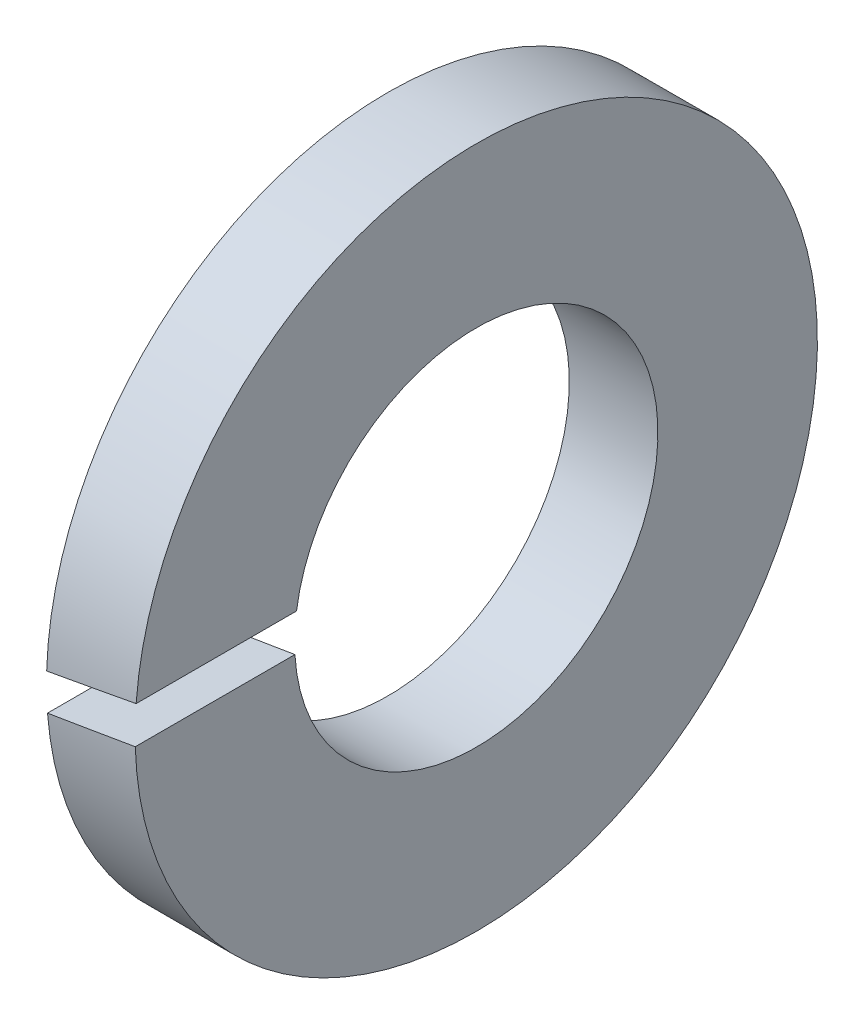
ISO-10303-21;
HEADER;
FILE_DESCRIPTION(('STEP AP214'),'2;1');
FILE_NAME('part.step','',(''),(''),'','','');
FILE_SCHEMA(('AUTOMOTIVE_DESIGN { 1 0 10303 214 1 1 1 1 }'));
ENDSEC;
DATA;
#1=APPLICATION_CONTEXT('core data for automotive mechanical design processes');
#2=APPLICATION_PROTOCOL_DEFINITION('international standard','automotive_design',2000,#1);
#3=PRODUCT_CONTEXT('',#1,'mechanical');
#4=PRODUCT('Part','Part','',(#3));
#5=PRODUCT_RELATED_PRODUCT_CATEGORY('part','',(#4));
#6=PRODUCT_DEFINITION_FORMATION('','',#4);
#7=PRODUCT_DEFINITION_CONTEXT('part definition',#1,'design');
#8=PRODUCT_DEFINITION('design','',#6,#7);
#9=PRODUCT_DEFINITION_SHAPE('','',#8);
#10=(LENGTH_UNIT() NAMED_UNIT(*) SI_UNIT(.MILLI.,.METRE.));
#11=(NAMED_UNIT(*) PLANE_ANGLE_UNIT() SI_UNIT($,.RADIAN.));
#12=(NAMED_UNIT(*) SI_UNIT($,.STERADIAN.) SOLID_ANGLE_UNIT());
#13=UNCERTAINTY_MEASURE_WITH_UNIT(LENGTH_MEASURE(1.E-05),#10,'distance_accuracy_value','');
#14=(GEOMETRIC_REPRESENTATION_CONTEXT(3) GLOBAL_UNCERTAINTY_ASSIGNED_CONTEXT((#13)) GLOBAL_UNIT_ASSIGNED_CONTEXT((#10,
#11,#12)) REPRESENTATION_CONTEXT('',''));
#15=CARTESIAN_POINT('',(0.,0.,0.));
#16=DIRECTION('',(0.,0.,1.));
#17=DIRECTION('',(1.,0.,0.));
#18=AXIS2_PLACEMENT_3D('',#15,#16,#17);
#19=CARTESIAN_POINT('',(-1.,5.9,0.));
#20=DIRECTION('',(-1.,0.,0.));
#21=DIRECTION('',(0.,0.,1.));
#22=AXIS2_PLACEMENT_3D('',#19,#20,#21);
#23=PLANE('',#22);
#24=DIRECTION('',(0.,0.,1.));
#25=VECTOR('',#24,1.);
#26=CARTESIAN_POINT('',(-1.,-0.59265189158162,0.));
#27=LINE('',#26,#25);
#28=CARTESIAN_POINT('',(-1.,-0.592651891581621,7.67715857172462));
#29=VERTEX_POINT('',#28);
#30=CARTESIAN_POINT('',(-1.,-0.59265189158162,4.05694019371801));
#31=VERTEX_POINT('',#30);
#32=EDGE_CURVE('E54',#29,#31,#27,.F.);
#33=ORIENTED_EDGE('',*,*,#32,.T.);
#34=CARTESIAN_POINT('',(-1.,0.,0.));
#35=DIRECTION('',(1.,0.,0.));
#36=DIRECTION('',(0.,0.,-1.));
#37=AXIS2_PLACEMENT_3D('',#34,#35,#36);
#38=CIRCLE('',#37,4.1);
#39=CARTESIAN_POINT('',(-1.,0.239997930164691,4.09296970346919));
#40=VERTEX_POINT('',#39);
#41=EDGE_CURVE('E21',#31,#40,#38,.T.);
#42=ORIENTED_EDGE('',*,*,#41,.T.);
#43=DIRECTION('',(0.,0.,1.));
#44=VECTOR('',#43,1.);
#45=CARTESIAN_POINT('',(-1.,0.239997930164691,0.));
#46=LINE('',#45,#44);
#47=CARTESIAN_POINT('',(-1.,0.239997930164691,7.69625889595176));
#48=VERTEX_POINT('',#47);
#49=EDGE_CURVE('E58',#40,#48,#46,.T.);
#50=ORIENTED_EDGE('',*,*,#49,.T.);
#51=CARTESIAN_POINT('',(-1.,0.,0.));
#52=DIRECTION('',(1.,0.,0.));
#53=DIRECTION('',(0.,0.,-1.));
#54=AXIS2_PLACEMENT_3D('',#51,#52,#53);
#55=CIRCLE('',#54,7.7);
#56=EDGE_CURVE('E81',#29,#48,#55,.T.);
#57=ORIENTED_EDGE('',*,*,#56,.F.);
#58=EDGE_LOOP('',(#33,#42,#50,#57));
#59=FACE_BOUND('',#58,.T.);
#60=ADVANCED_FACE('F18',(#59),#23,.T.);
#61=CARTESIAN_POINT('',(-2.04081125886786,0.056474823401145,0.));
#62=DIRECTION('',(-0.17364817766693,0.984807753012208,0.));
#63=DIRECTION('',(-0.984807753012208,-0.17364817766693,0.));
#64=AXIS2_PLACEMENT_3D('',#61,#62,#63);
#65=PLANE('',#64);
#66=CARTESIAN_POINT('',(-2.3610958980889,0.,0.));
#67=DIRECTION('',(-0.17364817766693,0.984807753012208,0.));
#68=DIRECTION('',(0.984807753012208,0.17364817766693,0.));
#69=AXIS2_PLACEMENT_3D('',#66,#67,#68);
#70=ELLIPSE('',#69,44.3425327202061,7.7);
#71=CARTESIAN_POINT('',(1.,0.59265189158162,7.67715857172461));
#72=VERTEX_POINT('',#71);
#73=EDGE_CURVE('E69',#48,#72,#70,.T.);
#74=ORIENTED_EDGE('',*,*,#73,.F.);
#75=ORIENTED_EDGE('',*,*,#49,.F.);
#76=CARTESIAN_POINT('',(-2.3610958980889,0.,0.));
#77=DIRECTION('',(-0.17364817766693,0.984807753012208,0.));
#78=DIRECTION('',(0.984807753012208,0.17364817766693,0.));
#79=AXIS2_PLACEMENT_3D('',#76,#77,#78);
#80=ELLIPSE('',#79,23.6109589808889,4.1);
#81=CARTESIAN_POINT('',(1.,0.59265189158162,4.05694019371801));
#82=VERTEX_POINT('',#81);
#83=EDGE_CURVE('E63',#40,#82,#80,.T.);
#84=ORIENTED_EDGE('',*,*,#83,.T.);
#85=DIRECTION('',(0.,0.,-1.));
#86=VECTOR('',#85,1.);
#87=CARTESIAN_POINT('',(1.,0.59265189158162,0.));
#88=LINE('',#87,#86);
#89=EDGE_CURVE('E84',#72,#82,#88,.T.);
#90=ORIENTED_EDGE('',*,*,#89,.F.);
#91=EDGE_LOOP('',(#74,#75,#84,#90));
#92=FACE_BOUND('',#91,.T.);
#93=ADVANCED_FACE('F65',(#92),#65,.F.);
#94=CARTESIAN_POINT('',(0.,0.,0.));
#95=DIRECTION('',(1.,0.,0.));
#96=DIRECTION('',(0.,0.,-1.));
#97=AXIS2_PLACEMENT_3D('',#94,#95,#96);
#98=CYLINDRICAL_SURFACE('',#97,4.1);
#99=ORIENTED_EDGE('',*,*,#83,.F.);
#100=ORIENTED_EDGE('',*,*,#41,.F.);
#101=CARTESIAN_POINT('',(2.3610958980889,0.,0.));
#102=DIRECTION('',(0.17364817766693,-0.984807753012208,0.));
#103=DIRECTION('',(0.984807753012208,0.17364817766693,0.));
#104=AXIS2_PLACEMENT_3D('',#101,#102,#103);
#105=ELLIPSE('',#104,23.6109589808889,4.1);
#106=CARTESIAN_POINT('',(1.,-0.23999793016469,4.09296970346919));
#107=VERTEX_POINT('',#106);
#108=EDGE_CURVE('E76',#31,#107,#105,.F.);
#109=ORIENTED_EDGE('',*,*,#108,.T.);
#110=CARTESIAN_POINT('',(1.,0.,0.));
#111=DIRECTION('',(1.,0.,0.));
#112=DIRECTION('',(0.,0.,-1.));
#113=AXIS2_PLACEMENT_3D('',#110,#111,#112);
#114=CIRCLE('',#113,4.1);
#115=EDGE_CURVE('E74',#82,#107,#114,.F.);
#116=ORIENTED_EDGE('',*,*,#115,.F.);
#117=EDGE_LOOP('',(#99,#100,#109,#116));
#118=FACE_BOUND('',#117,.T.);
#119=ADVANCED_FACE('F72',(#118),#98,.F.);
#120=CARTESIAN_POINT('',(2.04081125886786,-0.056474823401145,0.));
#121=DIRECTION('',(0.17364817766693,-0.984807753012208,0.));
#122=DIRECTION('',(0.984807753012208,0.17364817766693,0.));
#123=AXIS2_PLACEMENT_3D('',#120,#121,#122);
#124=PLANE('',#123);
#125=ORIENTED_EDGE('',*,*,#108,.F.);
#126=ORIENTED_EDGE('',*,*,#32,.F.);
#127=CARTESIAN_POINT('',(2.3610958980889,0.,0.));
#128=DIRECTION('',(0.17364817766693,-0.984807753012208,0.));
#129=DIRECTION('',(0.984807753012208,0.17364817766693,0.));
#130=AXIS2_PLACEMENT_3D('',#127,#128,#129);
#131=ELLIPSE('',#130,44.3425327202061,7.7);
#132=CARTESIAN_POINT('',(1.,-0.23999793016469,7.69625889595176));
#133=VERTEX_POINT('',#132);
#134=EDGE_CURVE('E36',#133,#29,#131,.T.);
#135=ORIENTED_EDGE('',*,*,#134,.F.);
#136=DIRECTION('',(0.,0.,-1.));
#137=VECTOR('',#136,1.);
#138=CARTESIAN_POINT('',(1.,-0.23999793016469,0.));
#139=LINE('',#138,#137);
#140=EDGE_CURVE('E27',#107,#133,#139,.F.);
#141=ORIENTED_EDGE('',*,*,#140,.F.);
#142=EDGE_LOOP('',(#125,#126,#135,#141));
#143=FACE_BOUND('',#142,.T.);
#144=ADVANCED_FACE('F91',(#143),#124,.F.);
#145=CARTESIAN_POINT('',(0.,0.,0.));
#146=DIRECTION('',(1.,0.,0.));
#147=DIRECTION('',(0.,0.,-1.));
#148=AXIS2_PLACEMENT_3D('',#145,#146,#147);
#149=CYLINDRICAL_SURFACE('',#148,7.7);
#150=ORIENTED_EDGE('',*,*,#56,.T.);
#151=ORIENTED_EDGE('',*,*,#73,.T.);
#152=CARTESIAN_POINT('',(1.,0.,0.));
#153=DIRECTION('',(1.,0.,0.));
#154=DIRECTION('',(0.,0.,-1.));
#155=AXIS2_PLACEMENT_3D('',#152,#153,#154);
#156=CIRCLE('',#155,7.7);
#157=EDGE_CURVE('E11',#133,#72,#156,.T.);
#158=ORIENTED_EDGE('',*,*,#157,.F.);
#159=ORIENTED_EDGE('',*,*,#134,.T.);
#160=EDGE_LOOP('',(#150,#151,#158,#159));
#161=FACE_BOUND('',#160,.T.);
#162=ADVANCED_FACE('F93',(#161),#149,.T.);
#163=CARTESIAN_POINT('',(1.,5.9,0.));
#164=DIRECTION('',(1.,0.,0.));
#165=DIRECTION('',(0.,0.,-1.));
#166=AXIS2_PLACEMENT_3D('',#163,#164,#165);
#167=PLANE('',#166);
#168=ORIENTED_EDGE('',*,*,#140,.T.);
#169=ORIENTED_EDGE('',*,*,#157,.T.);
#170=ORIENTED_EDGE('',*,*,#89,.T.);
#171=ORIENTED_EDGE('',*,*,#115,.T.);
#172=EDGE_LOOP('',(#168,#169,#170,#171));
#173=FACE_BOUND('',#172,.T.);
#174=ADVANCED_FACE('F90',(#173),#167,.T.);
#175=CLOSED_SHELL('',(#60,#93,#119,#144,#162,#174));
#176=MANIFOLD_SOLID_BREP('B1',#175);
#177=ADVANCED_BREP_SHAPE_REPRESENTATION('',(#18,#176),#14);
#178=SHAPE_DEFINITION_REPRESENTATION(#9,#177);
ENDSEC;
END-ISO-10303-21;
